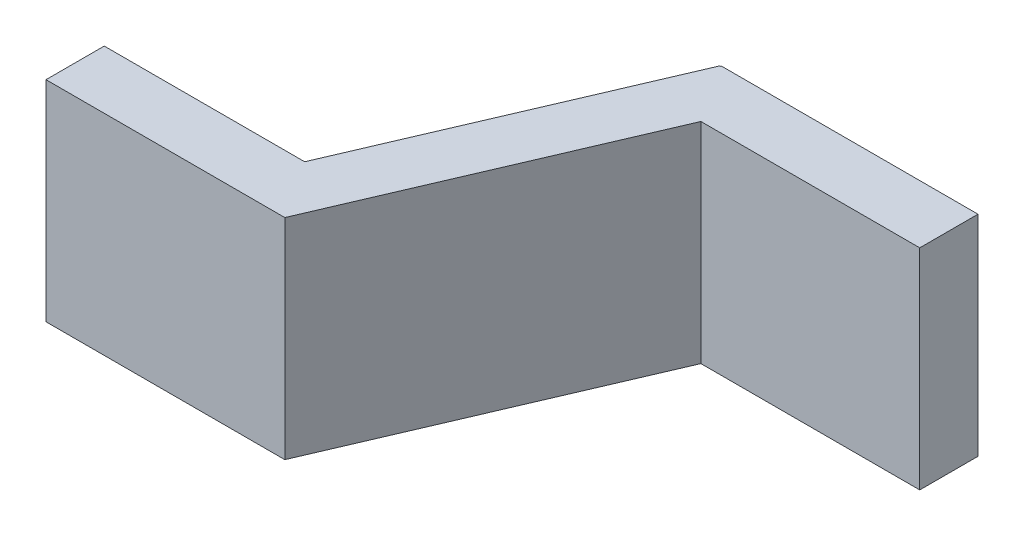
ISO-10303-21;
HEADER;
FILE_DESCRIPTION(('STEP AP214'),'2;1');
FILE_NAME('part.step','',(''),(''),'','','');
FILE_SCHEMA(('AUTOMOTIVE_DESIGN { 1 0 10303 214 1 1 1 1 }'));
ENDSEC;
DATA;
#1=APPLICATION_CONTEXT('core data for automotive mechanical design processes');
#2=APPLICATION_PROTOCOL_DEFINITION('international standard','automotive_design',2000,#1);
#3=PRODUCT_CONTEXT('',#1,'mechanical');
#4=PRODUCT('Part','Part','',(#3));
#5=PRODUCT_RELATED_PRODUCT_CATEGORY('part','',(#4));
#6=PRODUCT_DEFINITION_FORMATION('','',#4);
#7=PRODUCT_DEFINITION_CONTEXT('part definition',#1,'design');
#8=PRODUCT_DEFINITION('design','',#6,#7);
#9=PRODUCT_DEFINITION_SHAPE('','',#8);
#10=(LENGTH_UNIT() NAMED_UNIT(*) SI_UNIT(.MILLI.,.METRE.));
#11=(NAMED_UNIT(*) PLANE_ANGLE_UNIT() SI_UNIT($,.RADIAN.));
#12=(NAMED_UNIT(*) SI_UNIT($,.STERADIAN.) SOLID_ANGLE_UNIT());
#13=UNCERTAINTY_MEASURE_WITH_UNIT(LENGTH_MEASURE(1.E-05),#10,'distance_accuracy_value','');
#14=(GEOMETRIC_REPRESENTATION_CONTEXT(3) GLOBAL_UNCERTAINTY_ASSIGNED_CONTEXT((#13)) GLOBAL_UNIT_ASSIGNED_CONTEXT((#10,
#11,#12)) REPRESENTATION_CONTEXT('',''));
#15=CARTESIAN_POINT('',(0.,0.,0.));
#16=DIRECTION('',(0.,0.,1.));
#17=DIRECTION('',(1.,0.,0.));
#18=AXIS2_PLACEMENT_3D('',#15,#16,#17);
#19=CARTESIAN_POINT('',(11.558086453539,5.02,0.0006058345056003));
#20=DIRECTION('',(-0.919135450912914,0.,-0.393941649073963));
#21=DIRECTION('',(-0.393941649073963,0.,0.919135450912914));
#22=AXIS2_PLACEMENT_3D('',#19,#20,#21);
#23=PLANE('',#22);
#24=DIRECTION('',(0.,1.,0.));
#25=VECTOR('',#24,1.);
#26=CARTESIAN_POINT('',(11.344046008361,5.02,0.5));
#27=LINE('',#26,#25);
#28=CARTESIAN_POINT('',(11.344046008361,5.02,0.5));
#29=VERTEX_POINT('',#28);
#30=CARTESIAN_POINT('',(11.344046008361,5.380000014305,0.5));
#31=VERTEX_POINT('',#30);
#32=EDGE_CURVE('E94',#29,#31,#27,.T.);
#33=ORIENTED_EDGE('',*,*,#32,.T.);
#34=DIRECTION('',(-0.393941649073123,0.,0.919135450913275));
#35=VECTOR('',#34,1.);
#36=CARTESIAN_POINT('',(11.558086453539,5.380000014305,0.000605834505600302));
#37=LINE('',#36,#35);
#38=CARTESIAN_POINT('',(11.558086453539,5.380000014305,0.000605834505577237));
#39=VERTEX_POINT('',#38);
#40=EDGE_CURVE('E121',#39,#31,#37,.T.);
#41=ORIENTED_EDGE('',*,*,#40,.F.);
#42=DIRECTION('',(0.,1.,0.));
#43=VECTOR('',#42,1.);
#44=CARTESIAN_POINT('',(11.558086453539,5.02,0.000605834505554305));
#45=LINE('',#44,#43);
#46=CARTESIAN_POINT('',(11.558086453539,5.02,0.000605834505584969));
#47=VERTEX_POINT('',#46);
#48=EDGE_CURVE('E110',#39,#47,#45,.F.);
#49=ORIENTED_EDGE('',*,*,#48,.T.);
#50=DIRECTION('',(-0.393941649073123,0.,0.919135450913275));
#51=VECTOR('',#50,1.);
#52=CARTESIAN_POINT('',(11.558086453539,5.02,0.000605834505600302));
#53=LINE('',#52,#51);
#54=EDGE_CURVE('E100',#47,#29,#53,.T.);
#55=ORIENTED_EDGE('',*,*,#54,.T.);
#56=EDGE_LOOP('',(#33,#41,#49,#55));
#57=FACE_BOUND('',#56,.T.);
#58=ADVANCED_FACE('F17',(#57),#23,.T.);
#59=CARTESIAN_POINT('',(11.,5.02,0.5));
#60=DIRECTION('',(0.,0.,1.));
#61=DIRECTION('',(1.,0.,0.));
#62=AXIS2_PLACEMENT_3D('',#59,#60,#61);
#63=PLANE('',#62);
#64=DIRECTION('',(1.,0.,0.));
#65=VECTOR('',#64,1.);
#66=CARTESIAN_POINT('',(11.65,5.380000014305,0.5));
#67=LINE('',#66,#65);
#68=CARTESIAN_POINT('',(11.,5.380000014305,0.5));
#69=VERTEX_POINT('',#68);
#70=EDGE_CURVE('E79',#31,#69,#67,.F.);
#71=ORIENTED_EDGE('',*,*,#70,.F.);
#72=ORIENTED_EDGE('',*,*,#32,.F.);
#73=DIRECTION('',(1.,0.,0.));
#74=VECTOR('',#73,1.);
#75=CARTESIAN_POINT('',(11.65,5.02,0.5));
#76=LINE('',#75,#74);
#77=CARTESIAN_POINT('',(11.,5.02,0.5));
#78=VERTEX_POINT('',#77);
#79=EDGE_CURVE('E169',#29,#78,#76,.F.);
#80=ORIENTED_EDGE('',*,*,#79,.T.);
#81=DIRECTION('',(0.,1.,0.));
#82=VECTOR('',#81,1.);
#83=CARTESIAN_POINT('',(11.,5.02,0.5));
#84=LINE('',#83,#82);
#85=EDGE_CURVE('E87',#78,#69,#84,.T.);
#86=ORIENTED_EDGE('',*,*,#85,.T.);
#87=EDGE_LOOP('',(#71,#72,#80,#86));
#88=FACE_BOUND('',#87,.T.);
#89=ADVANCED_FACE('F198',(#88),#63,.F.);
#90=CARTESIAN_POINT('',(11.,5.02,0.5));
#91=DIRECTION('',(1.,0.,0.));
#92=DIRECTION('',(0.,0.,-1.));
#93=AXIS2_PLACEMENT_3D('',#90,#91,#92);
#94=PLANE('',#93);
#95=ORIENTED_EDGE('',*,*,#85,.F.);
#96=DIRECTION('',(0.,0.,1.));
#97=VECTOR('',#96,1.);
#98=CARTESIAN_POINT('',(11.,5.02,0.04));
#99=LINE('',#98,#97);
#100=CARTESIAN_POINT('',(11.,5.02,0.60000000149));
#101=VERTEX_POINT('',#100);
#102=EDGE_CURVE('E153',#78,#101,#99,.T.);
#103=ORIENTED_EDGE('',*,*,#102,.T.);
#104=DIRECTION('',(0.,1.,0.));
#105=VECTOR('',#104,1.);
#106=CARTESIAN_POINT('',(11.,5.02,0.60000000149));
#107=LINE('',#106,#105);
#108=CARTESIAN_POINT('',(11.,5.380000014305,0.60000000149));
#109=VERTEX_POINT('',#108);
#110=EDGE_CURVE('E117',#109,#101,#107,.F.);
#111=ORIENTED_EDGE('',*,*,#110,.F.);
#112=DIRECTION('',(0.,0.,1.));
#113=VECTOR('',#112,1.);
#114=CARTESIAN_POINT('',(11.,5.380000014305,0.04));
#115=LINE('',#114,#113);
#116=EDGE_CURVE('E71',#69,#109,#115,.T.);
#117=ORIENTED_EDGE('',*,*,#116,.F.);
#118=EDGE_LOOP('',(#95,#103,#111,#117));
#119=FACE_BOUND('',#118,.T.);
#120=ADVANCED_FACE('F202',(#119),#94,.F.);
#121=CARTESIAN_POINT('',(11.999999997616,5.02,0.));
#122=DIRECTION('',(1.,0.,0.));
#123=DIRECTION('',(0.,0.,-1.));
#124=AXIS2_PLACEMENT_3D('',#121,#122,#123);
#125=PLANE('',#124);
#126=DIRECTION('',(0.,0.,1.));
#127=VECTOR('',#126,1.);
#128=CARTESIAN_POINT('',(11.999999997616,5.02,0.04));
#129=LINE('',#128,#127);
#130=CARTESIAN_POINT('',(11.999999997616,5.02,0.10000000149));
#131=VERTEX_POINT('',#130);
#132=CARTESIAN_POINT('',(11.999999997616,5.02,0.));
#133=VERTEX_POINT('',#132);
#134=EDGE_CURVE('E179',#131,#133,#129,.F.);
#135=ORIENTED_EDGE('',*,*,#134,.T.);
#136=DIRECTION('',(0.,1.,0.));
#137=VECTOR('',#136,1.);
#138=CARTESIAN_POINT('',(11.999999997616,5.02,0.));
#139=LINE('',#138,#137);
#140=CARTESIAN_POINT('',(11.999999997616,5.380000014305,0.));
#141=VERTEX_POINT('',#140);
#142=EDGE_CURVE('E174',#133,#141,#139,.T.);
#143=ORIENTED_EDGE('',*,*,#142,.T.);
#144=DIRECTION('',(0.,0.,1.));
#145=VECTOR('',#144,1.);
#146=CARTESIAN_POINT('',(11.999999997616,5.380000014305,0.04));
#147=LINE('',#146,#145);
#148=CARTESIAN_POINT('',(11.999999997616,5.380000014305,0.10000000149));
#149=VERTEX_POINT('',#148);
#150=EDGE_CURVE('E155',#149,#141,#147,.F.);
#151=ORIENTED_EDGE('',*,*,#150,.F.);
#152=DIRECTION('',(0.,1.,0.));
#153=VECTOR('',#152,1.);
#154=CARTESIAN_POINT('',(11.999999997616,5.02,0.10000000149));
#155=LINE('',#154,#153);
#156=EDGE_CURVE('E125',#131,#149,#155,.T.);
#157=ORIENTED_EDGE('',*,*,#156,.F.);
#158=EDGE_LOOP('',(#135,#143,#151,#157));
#159=FACE_BOUND('',#158,.T.);
#160=ADVANCED_FACE('F228',(#159),#125,.T.);
#161=CARTESIAN_POINT('',(11.56,5.02,0.));
#162=DIRECTION('',(0.,0.,1.));
#163=DIRECTION('',(1.,0.,0.));
#164=AXIS2_PLACEMENT_3D('',#161,#162,#163);
#165=PLANE('',#164);
#166=DIRECTION('',(1.,0.,0.));
#167=VECTOR('',#166,1.);
#168=CARTESIAN_POINT('',(11.65,5.02,0.));
#169=LINE('',#168,#167);
#170=CARTESIAN_POINT('',(11.56,5.02,0.));
#171=VERTEX_POINT('',#170);
#172=EDGE_CURVE('E150',#133,#171,#169,.F.);
#173=ORIENTED_EDGE('',*,*,#172,.T.);
#174=DIRECTION('',(0.,1.,0.));
#175=VECTOR('',#174,1.);
#176=CARTESIAN_POINT('',(11.56,5.02,0.));
#177=LINE('',#176,#175);
#178=CARTESIAN_POINT('',(11.56,5.380000014305,0.));
#179=VERTEX_POINT('',#178);
#180=EDGE_CURVE('E164',#171,#179,#177,.T.);
#181=ORIENTED_EDGE('',*,*,#180,.T.);
#182=DIRECTION('',(1.,0.,0.));
#183=VECTOR('',#182,1.);
#184=CARTESIAN_POINT('',(11.65,5.380000014305,0.));
#185=LINE('',#184,#183);
#186=EDGE_CURVE('E154',#141,#179,#185,.F.);
#187=ORIENTED_EDGE('',*,*,#186,.F.);
#188=ORIENTED_EDGE('',*,*,#142,.F.);
#189=EDGE_LOOP('',(#173,#181,#187,#188));
#190=FACE_BOUND('',#189,.T.);
#191=ADVANCED_FACE('F232',(#190),#165,.F.);
#192=CARTESIAN_POINT('',(11.56,5.02,0.));
#193=DIRECTION('',(1.,0.,0.));
#194=DIRECTION('',(0.,0.,-1.));
#195=AXIS2_PLACEMENT_3D('',#192,#193,#194);
#196=PLANE('',#195);
#197=DIRECTION('',(0.,1.,0.));
#198=VECTOR('',#197,1.);
#199=CARTESIAN_POINT('',(11.56,5.02,0.00142598092431268));
#200=LINE('',#199,#198);
#201=CARTESIAN_POINT('',(11.56,5.02,0.00142598092431734));
#202=VERTEX_POINT('',#201);
#203=CARTESIAN_POINT('',(11.56,5.380000014305,0.00142598092431734));
#204=VERTEX_POINT('',#203);
#205=EDGE_CURVE('E118',#202,#204,#200,.T.);
#206=ORIENTED_EDGE('',*,*,#205,.T.);
#207=DIRECTION('',(0.,0.,1.));
#208=VECTOR('',#207,1.);
#209=CARTESIAN_POINT('',(11.56,5.380000014305,0.04));
#210=LINE('',#209,#208);
#211=EDGE_CURVE('E123',#179,#204,#210,.T.);
#212=ORIENTED_EDGE('',*,*,#211,.F.);
#213=ORIENTED_EDGE('',*,*,#180,.F.);
#214=DIRECTION('',(0.,0.,-1.));
#215=VECTOR('',#214,1.);
#216=CARTESIAN_POINT('',(11.56,5.02,0.));
#217=LINE('',#216,#215);
#218=EDGE_CURVE('E147',#171,#202,#217,.F.);
#219=ORIENTED_EDGE('',*,*,#218,.T.);
#220=EDGE_LOOP('',(#206,#212,#213,#219));
#221=FACE_BOUND('',#220,.T.);
#222=ADVANCED_FACE('F234',(#221),#196,.F.);
#223=CARTESIAN_POINT('',(11.65,5.02,0.04));
#224=DIRECTION('',(-0.393941649073963,0.,0.919135450912914));
#225=DIRECTION('',(0.919135450912914,0.,0.393941649073963));
#226=AXIS2_PLACEMENT_3D('',#223,#224,#225);
#227=PLANE('',#226);
#228=DIRECTION('',(-0.919135450920459,0.,-0.393941649056361));
#229=VECTOR('',#228,1.);
#230=CARTESIAN_POINT('',(11.56,5.380000014305,0.001425980924322));
#231=LINE('',#230,#229);
#232=EDGE_CURVE('E113',#204,#39,#231,.T.);
#233=ORIENTED_EDGE('',*,*,#232,.F.);
#234=ORIENTED_EDGE('',*,*,#205,.F.);
#235=DIRECTION('',(-0.919135450920459,0.,-0.393941649056361));
#236=VECTOR('',#235,1.);
#237=CARTESIAN_POINT('',(11.56,5.02,0.001425980924322));
#238=LINE('',#237,#236);
#239=EDGE_CURVE('E114',#202,#47,#238,.T.);
#240=ORIENTED_EDGE('',*,*,#239,.T.);
#241=ORIENTED_EDGE('',*,*,#48,.F.);
#242=EDGE_LOOP('',(#233,#234,#240,#241));
#243=FACE_BOUND('',#242,.T.);
#244=ADVANCED_FACE('F112',(#243),#227,.F.);
#245=CARTESIAN_POINT('',(11.,5.02,0.60000000149));
#246=DIRECTION('',(0.,0.,1.));
#247=DIRECTION('',(1.,0.,0.));
#248=AXIS2_PLACEMENT_3D('',#245,#246,#247);
#249=PLANE('',#248);
#250=DIRECTION('',(0.,1.,0.));
#251=VECTOR('',#250,1.);
#252=CARTESIAN_POINT('',(11.4099838806682,5.02,0.60000000149));
#253=LINE('',#252,#251);
#254=CARTESIAN_POINT('',(11.4099838806682,5.02,0.60000000149));
#255=VERTEX_POINT('',#254);
#256=CARTESIAN_POINT('',(11.4099838806682,5.380000014305,0.60000000149));
#257=VERTEX_POINT('',#256);
#258=EDGE_CURVE('E144',#255,#257,#253,.T.);
#259=ORIENTED_EDGE('',*,*,#258,.T.);
#260=DIRECTION('',(1.,0.,0.));
#261=VECTOR('',#260,1.);
#262=CARTESIAN_POINT('',(11.65,5.380000014305,0.60000000149));
#263=LINE('',#262,#261);
#264=EDGE_CURVE('E20',#109,#257,#263,.T.);
#265=ORIENTED_EDGE('',*,*,#264,.F.);
#266=ORIENTED_EDGE('',*,*,#110,.T.);
#267=DIRECTION('',(1.,0.,0.));
#268=VECTOR('',#267,1.);
#269=CARTESIAN_POINT('',(11.,5.02,0.60000000149));
#270=LINE('',#269,#268);
#271=EDGE_CURVE('E151',#101,#255,#270,.T.);
#272=ORIENTED_EDGE('',*,*,#271,.T.);
#273=EDGE_LOOP('',(#259,#265,#266,#272));
#274=FACE_BOUND('',#273,.T.);
#275=ADVANCED_FACE('F205',(#274),#249,.T.);
#276=CARTESIAN_POINT('',(11.65,5.380000014305,0.04));
#277=DIRECTION('',(0.,1.,0.));
#278=DIRECTION('',(0.,0.,1.));
#279=AXIS2_PLACEMENT_3D('',#276,#277,#278);
#280=PLANE('',#279);
#281=ORIENTED_EDGE('',*,*,#211,.T.);
#282=ORIENTED_EDGE('',*,*,#232,.T.);
#283=ORIENTED_EDGE('',*,*,#40,.T.);
#284=ORIENTED_EDGE('',*,*,#70,.T.);
#285=ORIENTED_EDGE('',*,*,#116,.T.);
#286=ORIENTED_EDGE('',*,*,#264,.T.);
#287=DIRECTION('',(-0.393941649073964,0.,0.919135450912914));
#288=VECTOR('',#287,1.);
#289=CARTESIAN_POINT('',(11.6242839866442,5.380000014305,0.100000001490094));
#290=LINE('',#289,#288);
#291=CARTESIAN_POINT('',(11.6242839866442,5.380000014305,0.100000001490047));
#292=VERTEX_POINT('',#291);
#293=EDGE_CURVE('E141',#257,#292,#290,.F.);
#294=ORIENTED_EDGE('',*,*,#293,.T.);
#295=DIRECTION('',(1.,0.,0.));
#296=VECTOR('',#295,1.);
#297=CARTESIAN_POINT('',(11.56,5.380000014305,0.10000000149));
#298=LINE('',#297,#296);
#299=EDGE_CURVE('E170',#149,#292,#298,.F.);
#300=ORIENTED_EDGE('',*,*,#299,.F.);
#301=ORIENTED_EDGE('',*,*,#150,.T.);
#302=ORIENTED_EDGE('',*,*,#186,.T.);
#303=EDGE_LOOP('',(#281,#282,#283,#284,#285,#286,#294,#300,#301,#302));
#304=FACE_BOUND('',#303,.T.);
#305=ADVANCED_FACE('F120',(#304),#280,.T.);
#306=CARTESIAN_POINT('',(11.56,5.02,0.10000000149));
#307=DIRECTION('',(0.,0.,1.));
#308=DIRECTION('',(1.,0.,0.));
#309=AXIS2_PLACEMENT_3D('',#306,#307,#308);
#310=PLANE('',#309);
#311=ORIENTED_EDGE('',*,*,#299,.T.);
#312=DIRECTION('',(0.,1.,0.));
#313=VECTOR('',#312,1.);
#314=CARTESIAN_POINT('',(11.6242839866442,5.02,0.100000001490094));
#315=LINE('',#314,#313);
#316=CARTESIAN_POINT('',(11.6242839866442,5.02,0.100000001490047));
#317=VERTEX_POINT('',#316);
#318=EDGE_CURVE('E26',#292,#317,#315,.F.);
#319=ORIENTED_EDGE('',*,*,#318,.T.);
#320=DIRECTION('',(1.,0.,0.));
#321=VECTOR('',#320,1.);
#322=CARTESIAN_POINT('',(11.65,5.02,0.10000000149));
#323=LINE('',#322,#321);
#324=EDGE_CURVE('E34',#317,#131,#323,.T.);
#325=ORIENTED_EDGE('',*,*,#324,.T.);
#326=ORIENTED_EDGE('',*,*,#156,.T.);
#327=EDGE_LOOP('',(#311,#319,#325,#326));
#328=FACE_BOUND('',#327,.T.);
#329=ADVANCED_FACE('F223',(#328),#310,.T.);
#330=CARTESIAN_POINT('',(11.65,5.02,0.04));
#331=DIRECTION('',(0.,1.,0.));
#332=DIRECTION('',(0.,0.,1.));
#333=AXIS2_PLACEMENT_3D('',#330,#331,#332);
#334=PLANE('',#333);
#335=ORIENTED_EDGE('',*,*,#218,.F.);
#336=ORIENTED_EDGE('',*,*,#172,.F.);
#337=ORIENTED_EDGE('',*,*,#134,.F.);
#338=ORIENTED_EDGE('',*,*,#324,.F.);
#339=DIRECTION('',(0.393941649073964,0.,-0.919135450912914));
#340=VECTOR('',#339,1.);
#341=CARTESIAN_POINT('',(11.4098164411035,5.02,0.600390667570103));
#342=LINE('',#341,#340);
#343=EDGE_CURVE('E11',#317,#255,#342,.F.);
#344=ORIENTED_EDGE('',*,*,#343,.T.);
#345=ORIENTED_EDGE('',*,*,#271,.F.);
#346=ORIENTED_EDGE('',*,*,#102,.F.);
#347=ORIENTED_EDGE('',*,*,#79,.F.);
#348=ORIENTED_EDGE('',*,*,#54,.F.);
#349=ORIENTED_EDGE('',*,*,#239,.F.);
#350=EDGE_LOOP('',(#335,#336,#337,#338,#344,#345,#346,#347,#348,#349));
#351=FACE_BOUND('',#350,.T.);
#352=ADVANCED_FACE('F200',(#351),#334,.F.);
#353=CARTESIAN_POINT('',(11.65,5.02,0.04));
#354=DIRECTION('',(-0.919135450912914,0.,-0.393941649073963));
#355=DIRECTION('',(-0.393941649073963,0.,0.919135450912914));
#356=AXIS2_PLACEMENT_3D('',#353,#354,#355);
#357=PLANE('',#356);
#358=ORIENTED_EDGE('',*,*,#318,.F.);
#359=ORIENTED_EDGE('',*,*,#293,.F.);
#360=ORIENTED_EDGE('',*,*,#258,.F.);
#361=ORIENTED_EDGE('',*,*,#343,.F.);
#362=EDGE_LOOP('',(#358,#359,#360,#361));
#363=FACE_BOUND('',#362,.T.);
#364=ADVANCED_FACE('F210',(#363),#357,.F.);
#365=CLOSED_SHELL('',(#58,#89,#120,#160,#191,#222,#244,#275,#305,#329,#352,#364));
#366=MANIFOLD_SOLID_BREP('B1',#365);
#367=ADVANCED_BREP_SHAPE_REPRESENTATION('',(#18,#366),#14);
#368=SHAPE_DEFINITION_REPRESENTATION(#9,#367);
ENDSEC;
END-ISO-10303-21;
